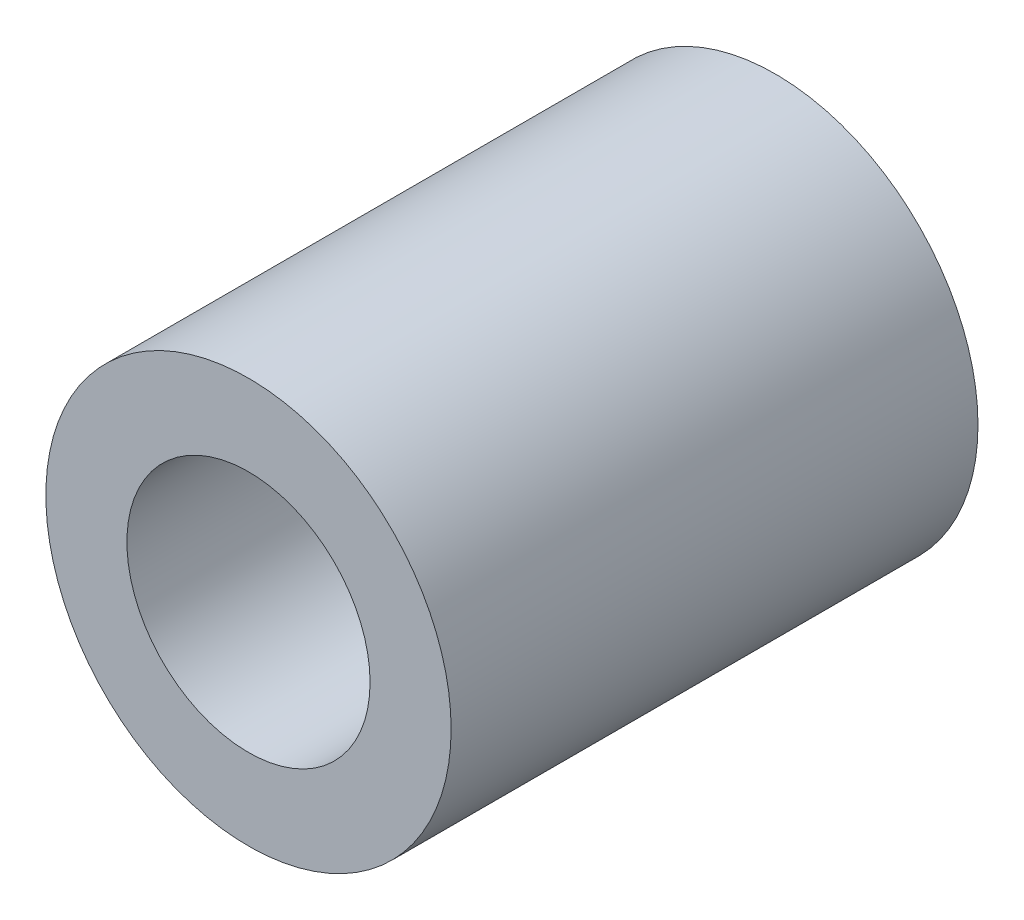
ISO-10303-21;
HEADER;
FILE_DESCRIPTION(('STEP AP214'),'2;1');
FILE_NAME('part.step','',(''),(''),'','','');
FILE_SCHEMA(('AUTOMOTIVE_DESIGN { 1 0 10303 214 1 1 1 1 }'));
ENDSEC;
DATA;
#1=APPLICATION_CONTEXT('core data for automotive mechanical design processes');
#2=APPLICATION_PROTOCOL_DEFINITION('international standard','automotive_design',2000,#1);
#3=PRODUCT_CONTEXT('',#1,'mechanical');
#4=PRODUCT('Part','Part','',(#3));
#5=PRODUCT_RELATED_PRODUCT_CATEGORY('part','',(#4));
#6=PRODUCT_DEFINITION_FORMATION('','',#4);
#7=PRODUCT_DEFINITION_CONTEXT('part definition',#1,'design');
#8=PRODUCT_DEFINITION('design','',#6,#7);
#9=PRODUCT_DEFINITION_SHAPE('','',#8);
#10=(LENGTH_UNIT() NAMED_UNIT(*) SI_UNIT(.MILLI.,.METRE.));
#11=(NAMED_UNIT(*) PLANE_ANGLE_UNIT() SI_UNIT($,.RADIAN.));
#12=(NAMED_UNIT(*) SI_UNIT($,.STERADIAN.) SOLID_ANGLE_UNIT());
#13=UNCERTAINTY_MEASURE_WITH_UNIT(LENGTH_MEASURE(1.E-05),#10,'distance_accuracy_value','');
#14=(GEOMETRIC_REPRESENTATION_CONTEXT(3) GLOBAL_UNCERTAINTY_ASSIGNED_CONTEXT((#13)) GLOBAL_UNIT_ASSIGNED_CONTEXT((#10,
#11,#12)) REPRESENTATION_CONTEXT('',''));
#15=CARTESIAN_POINT('',(0.,0.,0.));
#16=DIRECTION('',(0.,0.,1.));
#17=DIRECTION('',(1.,0.,0.));
#18=AXIS2_PLACEMENT_3D('',#15,#16,#17);
#19=CARTESIAN_POINT('',(0.,0.,13.));
#20=DIRECTION('',(0.,0.,1.));
#21=DIRECTION('',(1.,0.,0.));
#22=AXIS2_PLACEMENT_3D('',#19,#20,#21);
#23=PLANE('',#22);
#24=CARTESIAN_POINT('',(0.,0.,13.));
#25=DIRECTION('',(0.,0.,1.));
#26=DIRECTION('',(1.,0.,0.));
#27=AXIS2_PLACEMENT_3D('',#24,#25,#26);
#28=CIRCLE('',#27,5.);
#29=CARTESIAN_POINT('',(5.,0.,13.));
#30=VERTEX_POINT('',#29);
#31=EDGE_CURVE('E10',#30,#30,#28,.T.);
#32=ORIENTED_EDGE('',*,*,#31,.T.);
#33=EDGE_LOOP('',(#32));
#34=FACE_BOUND('',#33,.T.);
#35=CARTESIAN_POINT('',(0.,0.,13.));
#36=DIRECTION('',(0.,0.,1.));
#37=DIRECTION('',(1.,0.,0.));
#38=AXIS2_PLACEMENT_3D('',#35,#36,#37);
#39=CIRCLE('',#38,3.);
#40=CARTESIAN_POINT('',(3.,0.,13.));
#41=VERTEX_POINT('',#40);
#42=EDGE_CURVE('E41',#41,#41,#39,.T.);
#43=ORIENTED_EDGE('',*,*,#42,.F.);
#44=EDGE_LOOP('',(#43));
#45=FACE_BOUND('',#44,.T.);
#46=ADVANCED_FACE('F30',(#34,#45),#23,.T.);
#47=CARTESIAN_POINT('',(0.,0.,0.));
#48=DIRECTION('',(0.,0.,1.));
#49=DIRECTION('',(1.,0.,0.));
#50=AXIS2_PLACEMENT_3D('',#47,#48,#49);
#51=PLANE('',#50);
#52=CARTESIAN_POINT('',(0.,0.,0.));
#53=DIRECTION('',(0.,0.,1.));
#54=DIRECTION('',(1.,0.,0.));
#55=AXIS2_PLACEMENT_3D('',#52,#53,#54);
#56=CIRCLE('',#55,5.);
#57=CARTESIAN_POINT('',(5.,0.,0.));
#58=VERTEX_POINT('',#57);
#59=EDGE_CURVE('E34',#58,#58,#56,.T.);
#60=ORIENTED_EDGE('',*,*,#59,.F.);
#61=EDGE_LOOP('',(#60));
#62=FACE_BOUND('',#61,.T.);
#63=CARTESIAN_POINT('',(0.,0.,0.));
#64=DIRECTION('',(0.,0.,1.));
#65=DIRECTION('',(1.,0.,0.));
#66=AXIS2_PLACEMENT_3D('',#63,#64,#65);
#67=CIRCLE('',#66,3.);
#68=CARTESIAN_POINT('',(3.,0.,0.));
#69=VERTEX_POINT('',#68);
#70=EDGE_CURVE('E43',#69,#69,#67,.T.);
#71=ORIENTED_EDGE('',*,*,#70,.T.);
#72=EDGE_LOOP('',(#71));
#73=FACE_BOUND('',#72,.T.);
#74=ADVANCED_FACE('F53',(#62,#73),#51,.F.);
#75=CARTESIAN_POINT('',(0.,0.,13.));
#76=DIRECTION('',(0.,0.,-1.));
#77=DIRECTION('',(-1.,0.,0.));
#78=AXIS2_PLACEMENT_3D('',#75,#76,#77);
#79=CYLINDRICAL_SURFACE('',#78,5.);
#80=ORIENTED_EDGE('',*,*,#31,.F.);
#81=EDGE_LOOP('',(#80));
#82=FACE_BOUND('',#81,.T.);
#83=ORIENTED_EDGE('',*,*,#59,.T.);
#84=EDGE_LOOP('',(#83));
#85=FACE_BOUND('',#84,.T.);
#86=ADVANCED_FACE('F32',(#82,#85),#79,.T.);
#87=CARTESIAN_POINT('',(0.,0.,13.));
#88=DIRECTION('',(0.,0.,-1.));
#89=DIRECTION('',(-1.,0.,0.));
#90=AXIS2_PLACEMENT_3D('',#87,#88,#89);
#91=CYLINDRICAL_SURFACE('',#90,3.);
#92=ORIENTED_EDGE('',*,*,#42,.T.);
#93=EDGE_LOOP('',(#92));
#94=FACE_BOUND('',#93,.T.);
#95=ORIENTED_EDGE('',*,*,#70,.F.);
#96=EDGE_LOOP('',(#95));
#97=FACE_BOUND('',#96,.T.);
#98=ADVANCED_FACE('F49',(#94,#97),#91,.F.);
#99=CLOSED_SHELL('',(#46,#74,#86,#98));
#100=MANIFOLD_SOLID_BREP('B2',#99);
#101=ADVANCED_BREP_SHAPE_REPRESENTATION('',(#18,#100),#14);
#102=SHAPE_DEFINITION_REPRESENTATION(#9,#101);
ENDSEC;
END-ISO-10303-21;
